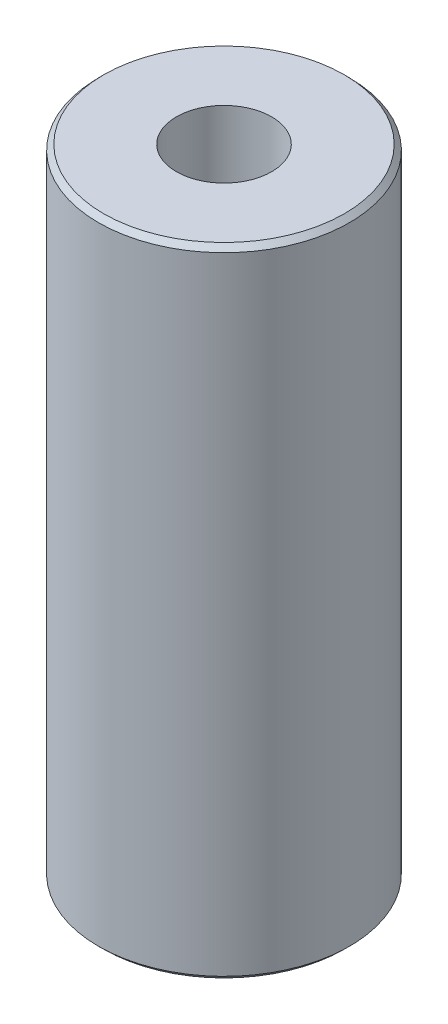
ISO-10303-21;
HEADER;
FILE_DESCRIPTION(('STEP AP214'),'2;1');
FILE_NAME('part.step','',(''),(''),'','','');
FILE_SCHEMA(('AUTOMOTIVE_DESIGN { 1 0 10303 214 1 1 1 1 }'));
ENDSEC;
DATA;
#1=APPLICATION_CONTEXT('core data for automotive mechanical design processes');
#2=APPLICATION_PROTOCOL_DEFINITION('international standard','automotive_design',2000,#1);
#3=PRODUCT_CONTEXT('',#1,'mechanical');
#4=PRODUCT('Part','Part','',(#3));
#5=PRODUCT_RELATED_PRODUCT_CATEGORY('part','',(#4));
#6=PRODUCT_DEFINITION_FORMATION('','',#4);
#7=PRODUCT_DEFINITION_CONTEXT('part definition',#1,'design');
#8=PRODUCT_DEFINITION('design','',#6,#7);
#9=PRODUCT_DEFINITION_SHAPE('','',#8);
#10=(LENGTH_UNIT() NAMED_UNIT(*) SI_UNIT(.MILLI.,.METRE.));
#11=(NAMED_UNIT(*) PLANE_ANGLE_UNIT() SI_UNIT($,.RADIAN.));
#12=(NAMED_UNIT(*) SI_UNIT($,.STERADIAN.) SOLID_ANGLE_UNIT());
#13=UNCERTAINTY_MEASURE_WITH_UNIT(LENGTH_MEASURE(1.E-05),#10,'distance_accuracy_value','');
#14=(GEOMETRIC_REPRESENTATION_CONTEXT(3) GLOBAL_UNCERTAINTY_ASSIGNED_CONTEXT((#13)) GLOBAL_UNIT_ASSIGNED_CONTEXT((#10,
#11,#12)) REPRESENTATION_CONTEXT('',''));
#15=CARTESIAN_POINT('',(0.,0.,0.));
#16=DIRECTION('',(0.,0.,1.));
#17=DIRECTION('',(1.,0.,0.));
#18=AXIS2_PLACEMENT_3D('',#15,#16,#17);
#19=CARTESIAN_POINT('',(0.,50.7780411847682,0.));
#20=DIRECTION('',(0.,-1.,0.));
#21=DIRECTION('',(0.,0.,-1.));
#22=AXIS2_PLACEMENT_3D('',#19,#20,#21);
#23=CYLINDRICAL_SURFACE('',#22,10.);
#24=CARTESIAN_POINT('',(0.,50.3619959017314,0.));
#25=DIRECTION('',(0.,1.,0.));
#26=DIRECTION('',(0.,0.,1.));
#27=AXIS2_PLACEMENT_3D('',#24,#25,#26);
#28=CIRCLE('',#27,10.);
#29=CARTESIAN_POINT('',(0.,50.3619959017314,-10.));
#30=VERTEX_POINT('',#29);
#31=EDGE_CURVE('E50',#30,#30,#28,.F.);
#32=ORIENTED_EDGE('',*,*,#31,.T.);
#33=EDGE_LOOP('',(#32));
#34=FACE_BOUND('',#33,.T.);
#35=CARTESIAN_POINT('',(0.,0.406846226914115,0.));
#36=DIRECTION('',(0.,1.,0.));
#37=DIRECTION('',(0.,0.,1.));
#38=AXIS2_PLACEMENT_3D('',#35,#36,#37);
#39=CIRCLE('',#38,10.);
#40=CARTESIAN_POINT('',(0.,0.406846226914115,10.));
#41=VERTEX_POINT('',#40);
#42=EDGE_CURVE('E51',#41,#41,#39,.T.);
#43=ORIENTED_EDGE('',*,*,#42,.T.);
#44=EDGE_LOOP('',(#43));
#45=FACE_BOUND('',#44,.T.);
#46=ADVANCED_FACE('F39',(#34,#45),#23,.T.);
#47=CARTESIAN_POINT('',(0.,50.7780411847682,0.));
#48=DIRECTION('',(0.,1.,0.));
#49=DIRECTION('',(0.,0.,1.));
#50=AXIS2_PLACEMENT_3D('',#47,#48,#49);
#51=PLANE('',#50);
#52=CARTESIAN_POINT('',(0.,50.7780411847682,0.));
#53=DIRECTION('',(0.,1.,0.));
#54=DIRECTION('',(0.,0.,1.));
#55=AXIS2_PLACEMENT_3D('',#52,#53,#54);
#56=CIRCLE('',#55,9.59315377308589);
#57=CARTESIAN_POINT('',(0.,50.7780411847682,-9.59315377308589));
#58=VERTEX_POINT('',#57);
#59=EDGE_CURVE('E54',#58,#58,#56,.T.);
#60=ORIENTED_EDGE('',*,*,#59,.T.);
#61=EDGE_LOOP('',(#60));
#62=FACE_BOUND('',#61,.T.);
#63=CARTESIAN_POINT('',(0.,50.7780411847682,0.));
#64=DIRECTION('',(0.,1.,0.));
#65=DIRECTION('',(0.,0.,1.));
#66=AXIS2_PLACEMENT_3D('',#63,#64,#65);
#67=CIRCLE('',#66,3.79513280409641);
#68=CARTESIAN_POINT('',(0.,50.7780411847682,3.79513280409641));
#69=VERTEX_POINT('',#68);
#70=EDGE_CURVE('E58',#69,#69,#67,.T.);
#71=ORIENTED_EDGE('',*,*,#70,.F.);
#72=EDGE_LOOP('',(#71));
#73=FACE_BOUND('',#72,.T.);
#74=ADVANCED_FACE('F69',(#62,#73),#51,.T.);
#75=CARTESIAN_POINT('',(0.,0.,0.));
#76=DIRECTION('',(0.,1.,0.));
#77=DIRECTION('',(0.,0.,1.));
#78=AXIS2_PLACEMENT_3D('',#75,#76,#77);
#79=PLANE('',#78);
#80=CARTESIAN_POINT('',(0.,0.,0.));
#81=DIRECTION('',(0.,1.,0.));
#82=DIRECTION('',(0.,0.,1.));
#83=AXIS2_PLACEMENT_3D('',#80,#81,#82);
#84=CIRCLE('',#83,9.58395471696319);
#85=CARTESIAN_POINT('',(0.,0.,9.58395471696319));
#86=VERTEX_POINT('',#85);
#87=EDGE_CURVE('E10',#86,#86,#84,.F.);
#88=ORIENTED_EDGE('',*,*,#87,.T.);
#89=EDGE_LOOP('',(#88));
#90=FACE_BOUND('',#89,.T.);
#91=CARTESIAN_POINT('',(0.,0.,0.));
#92=DIRECTION('',(0.,1.,0.));
#93=DIRECTION('',(0.,0.,1.));
#94=AXIS2_PLACEMENT_3D('',#91,#92,#93);
#95=CIRCLE('',#94,3.79513280409641);
#96=CARTESIAN_POINT('',(0.,0.,3.79513280409641));
#97=VERTEX_POINT('',#96);
#98=EDGE_CURVE('E63',#97,#97,#95,.T.);
#99=ORIENTED_EDGE('',*,*,#98,.T.);
#100=EDGE_LOOP('',(#99));
#101=FACE_BOUND('',#100,.T.);
#102=ADVANCED_FACE('F75',(#90,#101),#79,.F.);
#103=CARTESIAN_POINT('',(0.,50.7780411847682,0.));
#104=DIRECTION('',(0.,-1.,0.));
#105=DIRECTION('',(0.,0.,-1.));
#106=AXIS2_PLACEMENT_3D('',#103,#104,#105);
#107=CYLINDRICAL_SURFACE('',#106,3.79513280409641);
#108=ORIENTED_EDGE('',*,*,#70,.T.);
#109=EDGE_LOOP('',(#108));
#110=FACE_BOUND('',#109,.T.);
#111=ORIENTED_EDGE('',*,*,#98,.F.);
#112=EDGE_LOOP('',(#111));
#113=FACE_BOUND('',#112,.T.);
#114=ADVANCED_FACE('F70',(#110,#113),#107,.F.);
#115=CARTESIAN_POINT('',(0.,50.7780411847682,0.));
#116=DIRECTION('',(0.,-1.,0.));
#117=DIRECTION('',(0.,0.,-1.));
#118=AXIS2_PLACEMENT_3D('',#115,#116,#117);
#119=CONICAL_SURFACE('',#118,9.59315377308589,0.77421968744764);
#120=CARTESIAN_POINT('',(0.,50.3619959017314,-10.));
#121=CARTESIAN_POINT('',(0.,50.366329706763,-9.99576201846965));
#122=CARTESIAN_POINT('',(0.,50.3706635117947,-9.99152403693929));
#123=CARTESIAN_POINT('',(0.,50.3793311218579,-9.98304807387858));
#124=CARTESIAN_POINT('',(0.,50.3836649268896,-9.97881009234823));
#125=CARTESIAN_POINT('',(0.,50.3923325369528,-9.97033412928752));
#126=CARTESIAN_POINT('',(0.,50.3966663419845,-9.96609614775716));
#127=CARTESIAN_POINT('',(0.,50.4053339520477,-9.95762018469645));
#128=CARTESIAN_POINT('',(0.,50.4096677570794,-9.9533822031661));
#129=CARTESIAN_POINT('',(0.,50.4183353671426,-9.94490624010538));
#130=CARTESIAN_POINT('',(0.,50.4226691721743,-9.94066825857503));
#131=CARTESIAN_POINT('',(0.,50.4313367822375,-9.93219229551432));
#132=CARTESIAN_POINT('',(0.,50.4356705872692,-9.92795431398396));
#133=CARTESIAN_POINT('',(0.,50.4443381973324,-9.91947835092325));
#134=CARTESIAN_POINT('',(0.,50.4486720023641,-9.9152403693929));
#135=CARTESIAN_POINT('',(0.,50.4573396124273,-9.90676440633218));
#136=CARTESIAN_POINT('',(0.,50.461673417459,-9.90252642480183));
#137=CARTESIAN_POINT('',(0.,50.4703410275222,-9.89405046174112));
#138=CARTESIAN_POINT('',(0.,50.4746748325539,-9.88981248021076));
#139=CARTESIAN_POINT('',(0.,50.4833424426171,-9.88133651715005));
#140=CARTESIAN_POINT('',(0.,50.4876762476488,-9.8770985356197));
#141=CARTESIAN_POINT('',(0.,50.496343857712,-9.86862257255899));
#142=CARTESIAN_POINT('',(0.,50.5006776627437,-9.86438459102863));
#143=CARTESIAN_POINT('',(0.,50.5093452728069,-9.85590862796792));
#144=CARTESIAN_POINT('',(0.,50.5136790778386,-9.85167064643757));
#145=CARTESIAN_POINT('',(0.,50.5223466879018,-9.84319468337685));
#146=CARTESIAN_POINT('',(0.,50.5266804929335,-9.8389567018465));
#147=CARTESIAN_POINT('',(0.,50.5353481029967,-9.83048073878579));
#148=CARTESIAN_POINT('',(0.,50.5396819080284,-9.82624275725543));
#149=CARTESIAN_POINT('',(0.,50.5483495180916,-9.81776679419472));
#150=CARTESIAN_POINT('',(0.,50.5526833231233,-9.81352881266437));
#151=CARTESIAN_POINT('',(0.,50.5613509331865,-9.80505284960366));
#152=CARTESIAN_POINT('',(0.,50.5656847382182,-9.8008148680733));
#153=CARTESIAN_POINT('',(0.,50.5743523482814,-9.79233890501259));
#154=CARTESIAN_POINT('',(0.,50.5786861533131,-9.78810092348224));
#155=CARTESIAN_POINT('',(0.,50.5873537633763,-9.77962496042153));
#156=CARTESIAN_POINT('',(0.,50.591687568408,-9.77538697889117));
#157=CARTESIAN_POINT('',(0.,50.6003551784712,-9.76691101583046));
#158=CARTESIAN_POINT('',(0.,50.6046889835029,-9.76267303430011));
#159=CARTESIAN_POINT('',(0.,50.6133565935661,-9.75419707123939));
#160=CARTESIAN_POINT('',(0.,50.6176903985978,-9.74995908970904));
#161=CARTESIAN_POINT('',(0.,50.626358008661,-9.74148312664833));
#162=CARTESIAN_POINT('',(0.,50.6306918136927,-9.73724514511797));
#163=CARTESIAN_POINT('',(0.,50.6393594237559,-9.72876918205726));
#164=CARTESIAN_POINT('',(0.,50.6436932287876,-9.72453120052691));
#165=CARTESIAN_POINT('',(0.,50.6523608388508,-9.7160552374662));
#166=CARTESIAN_POINT('',(0.,50.6566946438825,-9.71181725593584));
#167=CARTESIAN_POINT('',(0.,50.6653622539457,-9.70334129287513));
#168=CARTESIAN_POINT('',(0.,50.6696960589774,-9.69910331134477));
#169=CARTESIAN_POINT('',(0.,50.6783636690406,-9.69062734828406));
#170=CARTESIAN_POINT('',(0.,50.6826974740723,-9.68638936675371));
#171=CARTESIAN_POINT('',(0.,50.6913650841355,-9.677913403693));
#172=CARTESIAN_POINT('',(0.,50.6956988891672,-9.67367542216264));
#173=CARTESIAN_POINT('',(0.,50.7043664992304,-9.66519945910193));
#174=CARTESIAN_POINT('',(0.,50.7087003042621,-9.66096147757158));
#175=CARTESIAN_POINT('',(0.,50.7173679143253,-9.65248551451086));
#176=CARTESIAN_POINT('',(0.,50.721701719357,-9.64824753298051));
#177=CARTESIAN_POINT('',(0.,50.7303693294202,-9.6397715699198));
#178=CARTESIAN_POINT('',(0.,50.7347031344519,-9.63553358838944));
#179=CARTESIAN_POINT('',(0.,50.7433707445151,-9.62705762532873));
#180=CARTESIAN_POINT('',(0.,50.7477045495468,-9.62281964379838));
#181=CARTESIAN_POINT('',(0.,50.75637215961,-9.61434368073767));
#182=CARTESIAN_POINT('',(0.,50.7607059646417,-9.61010569920731));
#183=CARTESIAN_POINT('',(0.,50.7693735747049,-9.6016297361466));
#184=CARTESIAN_POINT('',(0.,50.7737073797366,-9.59739175461625));
#185=CARTESIAN_POINT('',(0.,50.7780411847682,-9.59315377308589));
#186=B_SPLINE_CURVE_WITH_KNOTS('',3,(#120,#121,#122,#123,#124,#125,#126,#127,#128,#129,#130,
#131,#132,#133,#134,#135,#136,#137,#138,#139,#140,#141,#142,#143,#144,#145,#146,#147,#148,#149,
#150,#151,#152,#153,#154,#155,#156,#157,#158,#159,#160,#161,#162,#163,#164,#165,#166,#167,#168,
#169,#170,#171,#172,#173,#174,#175,#176,#177,#178,#179,#180,#181,#182,#183,#184,#185),
.UNSPECIFIED.,.F.,.F.,(4,2,2,2,2,2,2,2,2,2,2,2,2,2,2,2,2,2,2,2,2,2,2,2,2,2,2,2,2,2,2,2,4),(0.,
0.0181846413639266,0.0363692827278532,0.0545539240917799,0.0727385654557065,0.0909232068196331,
0.109107848183555,0.127292489547481,0.145477130911408,0.163661772275335,0.181846413639261,
0.200031055003183,0.21821569636711,0.236400337731036,0.254584979094963,0.272769620458889,
0.29095426182281,0.309138903186736,0.327323544550663,0.34550818591459,0.363692827278516,
0.381877468642443,0.400062110006365,0.418246751370291,0.436431392734218,0.454616034098144,
0.472800675462071,0.490985316825993,0.509169958189919,0.527354599553846,0.545539240917773,
0.563723882281699,0.581908523645626),.UNSPECIFIED.);
#187=EDGE_CURVE('BSEAM81',#30,#58,#186,.T.);
#188=ORIENTED_EDGE('',*,*,#31,.F.);
#189=ORIENTED_EDGE('',*,*,#59,.F.);
#190=ORIENTED_EDGE('',*,*,#187,.T.);
#191=ORIENTED_EDGE('',*,*,#187,.F.);
#192=EDGE_LOOP('',(#188,#190,#189,#191));
#193=FACE_BOUND('',#192,.T.);
#194=ADVANCED_FACE('F81',(#193),#119,.T.);
#195=CARTESIAN_POINT('',(0.,0.406846226914115,0.));
#196=DIRECTION('',(0.,1.,0.));
#197=DIRECTION('',(0.,0.,1.));
#198=AXIS2_PLACEMENT_3D('',#195,#196,#197);
#199=CONICAL_SURFACE('',#198,10.,0.79657663934726);
#200=ORIENTED_EDGE('',*,*,#87,.F.);
#201=EDGE_LOOP('',(#200));
#202=FACE_BOUND('',#201,.T.);
#203=ORIENTED_EDGE('',*,*,#42,.F.);
#204=EDGE_LOOP('',(#203));
#205=FACE_BOUND('',#204,.T.);
#206=ADVANCED_FACE('F45',(#202,#205),#199,.T.);
#207=CLOSED_SHELL('',(#46,#74,#102,#114,#194,#206));
#208=MANIFOLD_SOLID_BREP('B2',#207);
#209=ADVANCED_BREP_SHAPE_REPRESENTATION('',(#18,#208),#14);
#210=SHAPE_DEFINITION_REPRESENTATION(#9,#209);
ENDSEC;
END-ISO-10303-21;
